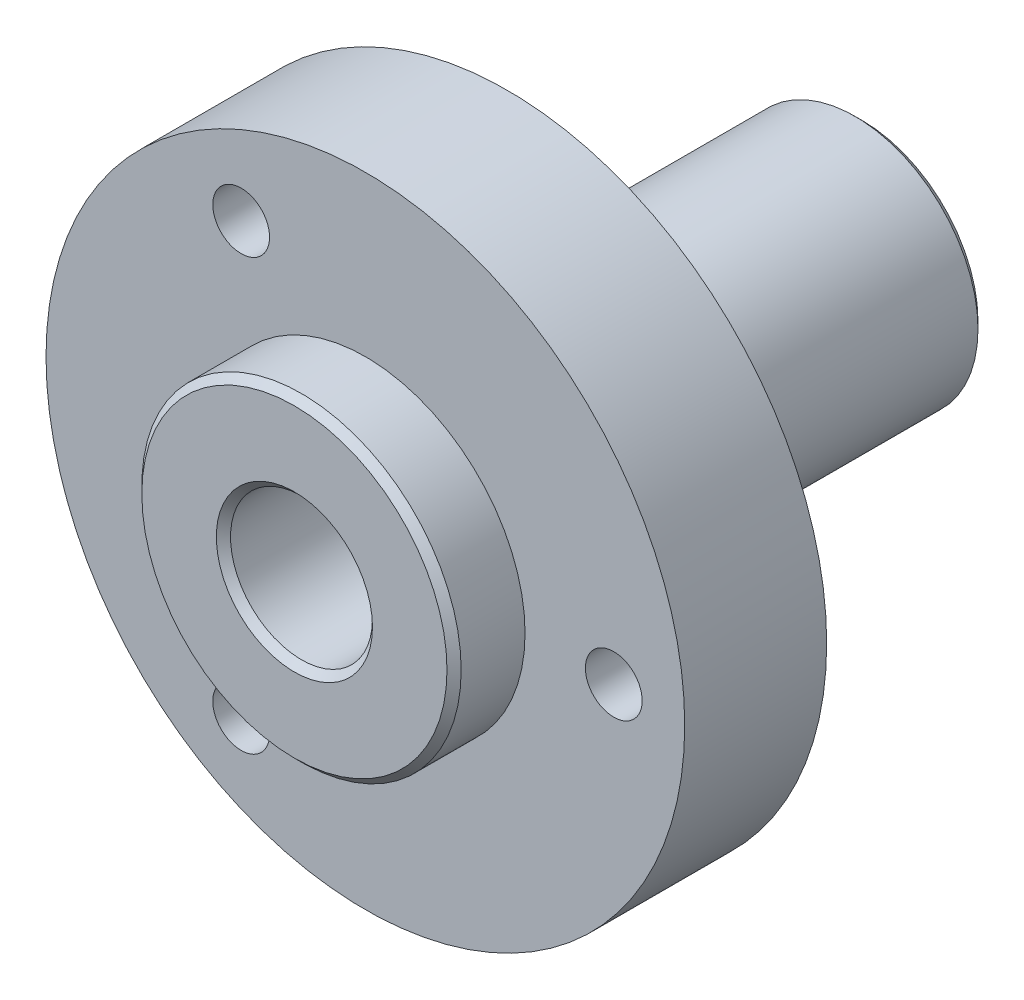
ISO-10303-21;
HEADER;
FILE_DESCRIPTION(('STEP AP214'),'2;1');
FILE_NAME('part.step','',(''),(''),'','','');
FILE_SCHEMA(('AUTOMOTIVE_DESIGN { 1 0 10303 214 1 1 1 1 }'));
ENDSEC;
DATA;
#1=APPLICATION_CONTEXT('core data for automotive mechanical design processes');
#2=APPLICATION_PROTOCOL_DEFINITION('international standard','automotive_design',2000,#1);
#3=PRODUCT_CONTEXT('',#1,'mechanical');
#4=PRODUCT('Part','Part','',(#3));
#5=PRODUCT_RELATED_PRODUCT_CATEGORY('part','',(#4));
#6=PRODUCT_DEFINITION_FORMATION('','',#4);
#7=PRODUCT_DEFINITION_CONTEXT('part definition',#1,'design');
#8=PRODUCT_DEFINITION('design','',#6,#7);
#9=PRODUCT_DEFINITION_SHAPE('','',#8);
#10=(LENGTH_UNIT() NAMED_UNIT(*) SI_UNIT(.MILLI.,.METRE.));
#11=(NAMED_UNIT(*) PLANE_ANGLE_UNIT() SI_UNIT($,.RADIAN.));
#12=(NAMED_UNIT(*) SI_UNIT($,.STERADIAN.) SOLID_ANGLE_UNIT());
#13=UNCERTAINTY_MEASURE_WITH_UNIT(LENGTH_MEASURE(1.E-05),#10,'distance_accuracy_value','');
#14=(GEOMETRIC_REPRESENTATION_CONTEXT(3) GLOBAL_UNCERTAINTY_ASSIGNED_CONTEXT((#13)) GLOBAL_UNIT_ASSIGNED_CONTEXT((#10,
#11,#12)) REPRESENTATION_CONTEXT('',''));
#15=CARTESIAN_POINT('',(0.,0.,0.));
#16=DIRECTION('',(0.,0.,1.));
#17=DIRECTION('',(1.,0.,0.));
#18=AXIS2_PLACEMENT_3D('',#15,#16,#17);
#19=CARTESIAN_POINT('',(0.,0.,-2.));
#20=DIRECTION('',(0.,0.,1.));
#21=DIRECTION('',(1.,0.,0.));
#22=AXIS2_PLACEMENT_3D('',#19,#20,#21);
#23=CYLINDRICAL_SURFACE('',#22,4.5);
#24=CARTESIAN_POINT('',(0.,0.,-0.199999999999994));
#25=DIRECTION('',(0.,0.,1.));
#26=DIRECTION('',(1.,0.,0.));
#27=AXIS2_PLACEMENT_3D('',#24,#25,#26);
#28=CIRCLE('',#27,4.5);
#29=CARTESIAN_POINT('',(4.5,0.,-0.199999999999994));
#30=VERTEX_POINT('',#29);
#31=EDGE_CURVE('E10',#30,#30,#28,.F.);
#32=ORIENTED_EDGE('',*,*,#31,.T.);
#33=EDGE_LOOP('',(#32));
#34=FACE_BOUND('',#33,.T.);
#35=CARTESIAN_POINT('',(0.,0.,-2.));
#36=DIRECTION('',(0.,0.,1.));
#37=DIRECTION('',(1.,0.,0.));
#38=AXIS2_PLACEMENT_3D('',#35,#36,#37);
#39=CIRCLE('',#38,4.5);
#40=CARTESIAN_POINT('',(4.5,0.,-2.));
#41=VERTEX_POINT('',#40);
#42=EDGE_CURVE('E77',#41,#41,#39,.T.);
#43=ORIENTED_EDGE('',*,*,#42,.T.);
#44=EDGE_LOOP('',(#43));
#45=FACE_BOUND('',#44,.T.);
#46=ADVANCED_FACE('F34',(#34,#45),#23,.T.);
#47=CARTESIAN_POINT('',(0.,0.,0.));
#48=DIRECTION('',(0.,0.,1.));
#49=DIRECTION('',(1.,0.,0.));
#50=AXIS2_PLACEMENT_3D('',#47,#48,#49);
#51=PLANE('',#50);
#52=CARTESIAN_POINT('',(0.,0.,0.));
#53=DIRECTION('',(0.,0.,1.));
#54=DIRECTION('',(1.,0.,0.));
#55=AXIS2_PLACEMENT_3D('',#52,#53,#54);
#56=CIRCLE('',#55,4.30000000000001);
#57=CARTESIAN_POINT('',(4.30000000000001,0.,0.));
#58=VERTEX_POINT('',#57);
#59=EDGE_CURVE('E41',#58,#58,#56,.T.);
#60=ORIENTED_EDGE('',*,*,#59,.T.);
#61=EDGE_LOOP('',(#60));
#62=FACE_BOUND('',#61,.T.);
#63=CARTESIAN_POINT('',(0.,0.,0.));
#64=DIRECTION('',(0.,0.,1.));
#65=DIRECTION('',(1.,0.,0.));
#66=AXIS2_PLACEMENT_3D('',#63,#64,#65);
#67=CIRCLE('',#66,2.2);
#68=CARTESIAN_POINT('',(2.2,0.,0.));
#69=VERTEX_POINT('',#68);
#70=EDGE_CURVE('E45',#69,#69,#67,.F.);
#71=ORIENTED_EDGE('',*,*,#70,.T.);
#72=EDGE_LOOP('',(#71));
#73=FACE_BOUND('',#72,.T.);
#74=ADVANCED_FACE('F115',(#62,#73),#51,.T.);
#75=CARTESIAN_POINT('',(0.,0.,-6.));
#76=DIRECTION('',(0.,0.,1.));
#77=DIRECTION('',(1.,0.,0.));
#78=AXIS2_PLACEMENT_3D('',#75,#76,#77);
#79=CYLINDRICAL_SURFACE('',#78,9.);
#80=CARTESIAN_POINT('',(0.,0.,-6.));
#81=DIRECTION('',(0.,0.,-1.));
#82=DIRECTION('',(-1.,0.,0.));
#83=AXIS2_PLACEMENT_3D('',#80,#81,#82);
#84=CIRCLE('',#83,9.);
#85=CARTESIAN_POINT('',(-9.,0.,-6.));
#86=VERTEX_POINT('',#85);
#87=EDGE_CURVE('E80',#86,#86,#84,.T.);
#88=ORIENTED_EDGE('',*,*,#87,.F.);
#89=EDGE_LOOP('',(#88));
#90=FACE_BOUND('',#89,.T.);
#91=CARTESIAN_POINT('',(0.,0.,-2.));
#92=DIRECTION('',(0.,0.,-1.));
#93=DIRECTION('',(-1.,0.,0.));
#94=AXIS2_PLACEMENT_3D('',#91,#92,#93);
#95=CIRCLE('',#94,9.);
#96=CARTESIAN_POINT('',(-9.,0.,-2.));
#97=VERTEX_POINT('',#96);
#98=EDGE_CURVE('E75',#97,#97,#95,.T.);
#99=ORIENTED_EDGE('',*,*,#98,.T.);
#100=EDGE_LOOP('',(#99));
#101=FACE_BOUND('',#100,.T.);
#102=ADVANCED_FACE('F113',(#90,#101),#79,.T.);
#103=CARTESIAN_POINT('',(0.,0.,-6.));
#104=DIRECTION('',(0.,0.,-1.));
#105=DIRECTION('',(-1.,0.,0.));
#106=AXIS2_PLACEMENT_3D('',#103,#104,#105);
#107=PLANE('',#106);
#108=CARTESIAN_POINT('',(-3.50000000000017,6.06217782649078,-6.));
#109=DIRECTION('',(0.,0.,-1.));
#110=DIRECTION('',(-1.,0.,0.));
#111=AXIS2_PLACEMENT_3D('',#108,#109,#110);
#112=CIRCLE('',#111,0.799999999999999);
#113=CARTESIAN_POINT('',(-4.30000000000017,6.06217782649078,-6.));
#114=VERTEX_POINT('',#113);
#115=EDGE_CURVE('E67',#114,#114,#112,.T.);
#116=ORIENTED_EDGE('',*,*,#115,.F.);
#117=EDGE_LOOP('',(#116));
#118=FACE_BOUND('',#117,.T.);
#119=CARTESIAN_POINT('',(-3.49999999999983,-6.06217782649136,-6.));
#120=DIRECTION('',(0.,0.,-1.));
#121=DIRECTION('',(-1.,0.,0.));
#122=AXIS2_PLACEMENT_3D('',#119,#120,#121);
#123=CIRCLE('',#122,0.799999999999999);
#124=CARTESIAN_POINT('',(-4.29999999999983,-6.06217782649136,-6.));
#125=VERTEX_POINT('',#124);
#126=EDGE_CURVE('E89',#125,#125,#123,.T.);
#127=ORIENTED_EDGE('',*,*,#126,.F.);
#128=EDGE_LOOP('',(#127));
#129=FACE_BOUND('',#128,.T.);
#130=CARTESIAN_POINT('',(7.,0.,-6.));
#131=DIRECTION('',(0.,0.,-1.));
#132=DIRECTION('',(-1.,0.,0.));
#133=AXIS2_PLACEMENT_3D('',#130,#131,#132);
#134=CIRCLE('',#133,0.799999999999999);
#135=CARTESIAN_POINT('',(6.2,0.,-6.));
#136=VERTEX_POINT('',#135);
#137=EDGE_CURVE('E72',#136,#136,#134,.T.);
#138=ORIENTED_EDGE('',*,*,#137,.F.);
#139=EDGE_LOOP('',(#138));
#140=FACE_BOUND('',#139,.T.);
#141=CARTESIAN_POINT('',(0.,0.,-6.));
#142=DIRECTION('',(0.,0.,-1.));
#143=DIRECTION('',(-1.,0.,0.));
#144=AXIS2_PLACEMENT_3D('',#141,#142,#143);
#145=CIRCLE('',#144,3.46378773558281);
#146=CARTESIAN_POINT('',(-3.46378773558281,0.,-6.));
#147=VERTEX_POINT('',#146);
#148=EDGE_CURVE('E66',#147,#147,#145,.T.);
#149=ORIENTED_EDGE('',*,*,#148,.F.);
#150=EDGE_LOOP('',(#149));
#151=FACE_BOUND('',#150,.T.);
#152=ORIENTED_EDGE('',*,*,#87,.T.);
#153=EDGE_LOOP('',(#152));
#154=FACE_BOUND('',#153,.T.);
#155=ADVANCED_FACE('F103',(#118,#129,#140,#151,#154),#107,.T.);
#156=CARTESIAN_POINT('',(0.,0.,-2.));
#157=DIRECTION('',(0.,0.,-1.));
#158=DIRECTION('',(-1.,0.,0.));
#159=AXIS2_PLACEMENT_3D('',#156,#157,#158);
#160=PLANE('',#159);
#161=CARTESIAN_POINT('',(-3.50000000000017,6.06217782649078,-2.));
#162=DIRECTION('',(0.,0.,1.));
#163=DIRECTION('',(1.,0.,0.));
#164=AXIS2_PLACEMENT_3D('',#161,#162,#163);
#165=CIRCLE('',#164,0.8);
#166=CARTESIAN_POINT('',(-2.70000000000017,6.06217782649078,-2.));
#167=VERTEX_POINT('',#166);
#168=EDGE_CURVE('E71',#167,#167,#165,.T.);
#169=ORIENTED_EDGE('',*,*,#168,.F.);
#170=EDGE_LOOP('',(#169));
#171=FACE_BOUND('',#170,.T.);
#172=CARTESIAN_POINT('',(-3.49999999999983,-6.06217782649136,-2.));
#173=DIRECTION('',(0.,0.,1.));
#174=DIRECTION('',(1.,0.,0.));
#175=AXIS2_PLACEMENT_3D('',#172,#173,#174);
#176=CIRCLE('',#175,0.8);
#177=CARTESIAN_POINT('',(-2.69999999999983,-6.06217782649136,-2.));
#178=VERTEX_POINT('',#177);
#179=EDGE_CURVE('E70',#178,#178,#176,.T.);
#180=ORIENTED_EDGE('',*,*,#179,.F.);
#181=EDGE_LOOP('',(#180));
#182=FACE_BOUND('',#181,.T.);
#183=CARTESIAN_POINT('',(7.,0.,-2.));
#184=DIRECTION('',(0.,0.,1.));
#185=DIRECTION('',(1.,0.,0.));
#186=AXIS2_PLACEMENT_3D('',#183,#184,#185);
#187=CIRCLE('',#186,0.8);
#188=CARTESIAN_POINT('',(7.8,0.,-2.));
#189=VERTEX_POINT('',#188);
#190=EDGE_CURVE('E76',#189,#189,#187,.T.);
#191=ORIENTED_EDGE('',*,*,#190,.F.);
#192=EDGE_LOOP('',(#191));
#193=FACE_BOUND('',#192,.T.);
#194=ORIENTED_EDGE('',*,*,#42,.F.);
#195=EDGE_LOOP('',(#194));
#196=FACE_BOUND('',#195,.T.);
#197=ORIENTED_EDGE('',*,*,#98,.F.);
#198=EDGE_LOOP('',(#197));
#199=FACE_BOUND('',#198,.T.);
#200=ADVANCED_FACE('F99',(#171,#182,#193,#196,#199),#160,.F.);
#201=CARTESIAN_POINT('',(0.,0.,-16.));
#202=DIRECTION('',(0.,0.,1.));
#203=DIRECTION('',(1.,0.,0.));
#204=AXIS2_PLACEMENT_3D('',#201,#202,#203);
#205=CYLINDRICAL_SURFACE('',#204,3.46378773558281);
#206=CARTESIAN_POINT('',(0.,0.,-15.8));
#207=DIRECTION('',(0.,0.,-1.));
#208=DIRECTION('',(-1.,0.,0.));
#209=AXIS2_PLACEMENT_3D('',#206,#207,#208);
#210=CIRCLE('',#209,3.46378773558281);
#211=CARTESIAN_POINT('',(-3.46378773558281,0.,-15.8));
#212=VERTEX_POINT('',#211);
#213=EDGE_CURVE('E57',#212,#212,#210,.F.);
#214=ORIENTED_EDGE('',*,*,#213,.T.);
#215=EDGE_LOOP('',(#214));
#216=FACE_BOUND('',#215,.T.);
#217=ORIENTED_EDGE('',*,*,#148,.T.);
#218=EDGE_LOOP('',(#217));
#219=FACE_BOUND('',#218,.T.);
#220=ADVANCED_FACE('F102',(#216,#219),#205,.T.);
#221=CARTESIAN_POINT('',(0.,0.,-16.));
#222=DIRECTION('',(0.,0.,-1.));
#223=DIRECTION('',(-1.,0.,0.));
#224=AXIS2_PLACEMENT_3D('',#221,#222,#223);
#225=PLANE('',#224);
#226=CARTESIAN_POINT('',(0.,0.,-16.));
#227=DIRECTION('',(0.,0.,-1.));
#228=DIRECTION('',(-1.,0.,0.));
#229=AXIS2_PLACEMENT_3D('',#226,#227,#228);
#230=CIRCLE('',#229,3.2637877355828);
#231=CARTESIAN_POINT('',(-3.2637877355828,0.,-16.));
#232=VERTEX_POINT('',#231);
#233=EDGE_CURVE('E60',#232,#232,#230,.T.);
#234=ORIENTED_EDGE('',*,*,#233,.T.);
#235=EDGE_LOOP('',(#234));
#236=FACE_BOUND('',#235,.T.);
#237=CARTESIAN_POINT('',(0.,0.,-16.));
#238=DIRECTION('',(0.,0.,-1.));
#239=DIRECTION('',(-1.,0.,0.));
#240=AXIS2_PLACEMENT_3D('',#237,#238,#239);
#241=CIRCLE('',#240,2.2);
#242=CARTESIAN_POINT('',(-2.2,0.,-16.));
#243=VERTEX_POINT('',#242);
#244=EDGE_CURVE('E63',#243,#243,#241,.F.);
#245=ORIENTED_EDGE('',*,*,#244,.T.);
#246=EDGE_LOOP('',(#245));
#247=FACE_BOUND('',#246,.T.);
#248=ADVANCED_FACE('F170',(#236,#247),#225,.T.);
#249=CARTESIAN_POINT('',(7.,0.,-2.));
#250=DIRECTION('',(0.,0.,1.));
#251=DIRECTION('',(1.,0.,0.));
#252=AXIS2_PLACEMENT_3D('',#249,#250,#251);
#253=CYLINDRICAL_SURFACE('',#252,0.799999999999999);
#254=ORIENTED_EDGE('',*,*,#137,.T.);
#255=EDGE_LOOP('',(#254));
#256=FACE_BOUND('',#255,.T.);
#257=ORIENTED_EDGE('',*,*,#190,.T.);
#258=EDGE_LOOP('',(#257));
#259=FACE_BOUND('',#258,.T.);
#260=ADVANCED_FACE('F166',(#256,#259),#253,.F.);
#261=CARTESIAN_POINT('',(-3.49999999999983,-6.06217782649136,-2.));
#262=DIRECTION('',(0.,0.,1.));
#263=DIRECTION('',(1.,0.,0.));
#264=AXIS2_PLACEMENT_3D('',#261,#262,#263);
#265=CYLINDRICAL_SURFACE('',#264,0.799999999999999);
#266=ORIENTED_EDGE('',*,*,#126,.T.);
#267=EDGE_LOOP('',(#266));
#268=FACE_BOUND('',#267,.T.);
#269=ORIENTED_EDGE('',*,*,#179,.T.);
#270=EDGE_LOOP('',(#269));
#271=FACE_BOUND('',#270,.T.);
#272=ADVANCED_FACE('F160',(#268,#271),#265,.F.);
#273=CARTESIAN_POINT('',(-3.50000000000017,6.06217782649078,-2.));
#274=DIRECTION('',(0.,0.,1.));
#275=DIRECTION('',(1.,0.,0.));
#276=AXIS2_PLACEMENT_3D('',#273,#274,#275);
#277=CYLINDRICAL_SURFACE('',#276,0.799999999999999);
#278=ORIENTED_EDGE('',*,*,#115,.T.);
#279=EDGE_LOOP('',(#278));
#280=FACE_BOUND('',#279,.T.);
#281=ORIENTED_EDGE('',*,*,#168,.T.);
#282=EDGE_LOOP('',(#281));
#283=FACE_BOUND('',#282,.T.);
#284=ADVANCED_FACE('F97',(#280,#283),#277,.F.);
#285=CARTESIAN_POINT('',(0.,0.,-16.));
#286=DIRECTION('',(0.,0.,1.));
#287=DIRECTION('',(1.,0.,0.));
#288=AXIS2_PLACEMENT_3D('',#285,#286,#287);
#289=CYLINDRICAL_SURFACE('',#288,2.);
#290=CARTESIAN_POINT('',(0.,0.,-15.8));
#291=DIRECTION('',(0.,0.,-1.));
#292=DIRECTION('',(-1.,0.,0.));
#293=AXIS2_PLACEMENT_3D('',#290,#291,#292);
#294=CIRCLE('',#293,2.);
#295=CARTESIAN_POINT('',(-2.,0.,-15.8));
#296=VERTEX_POINT('',#295);
#297=EDGE_CURVE('E49',#296,#296,#294,.T.);
#298=ORIENTED_EDGE('',*,*,#297,.T.);
#299=EDGE_LOOP('',(#298));
#300=FACE_BOUND('',#299,.T.);
#301=CARTESIAN_POINT('',(0.,0.,-0.199999999999999));
#302=DIRECTION('',(0.,0.,1.));
#303=DIRECTION('',(1.,0.,0.));
#304=AXIS2_PLACEMENT_3D('',#301,#302,#303);
#305=CIRCLE('',#304,2.);
#306=CARTESIAN_POINT('',(2.,0.,-0.199999999999999));
#307=VERTEX_POINT('',#306);
#308=EDGE_CURVE('E54',#307,#307,#305,.T.);
#309=ORIENTED_EDGE('',*,*,#308,.T.);
#310=EDGE_LOOP('',(#309));
#311=FACE_BOUND('',#310,.T.);
#312=ADVANCED_FACE('F136',(#300,#311),#289,.F.);
#313=CARTESIAN_POINT('',(0.,0.,-16.));
#314=DIRECTION('',(0.,0.,1.));
#315=DIRECTION('',(1.,0.,0.));
#316=AXIS2_PLACEMENT_3D('',#313,#314,#315);
#317=CONICAL_SURFACE('',#316,3.2637877355828,0.785398163397448);
#318=ORIENTED_EDGE('',*,*,#213,.F.);
#319=EDGE_LOOP('',(#318));
#320=FACE_BOUND('',#319,.T.);
#321=ORIENTED_EDGE('',*,*,#233,.F.);
#322=EDGE_LOOP('',(#321));
#323=FACE_BOUND('',#322,.T.);
#324=ADVANCED_FACE('F132',(#320,#323),#317,.T.);
#325=CARTESIAN_POINT('',(0.,0.,-16.));
#326=DIRECTION('',(0.,0.,-1.));
#327=DIRECTION('',(-1.,0.,0.));
#328=AXIS2_PLACEMENT_3D('',#325,#326,#327);
#329=CONICAL_SURFACE('',#328,2.2,0.785398163397453);
#330=ORIENTED_EDGE('',*,*,#297,.F.);
#331=EDGE_LOOP('',(#330));
#332=FACE_BOUND('',#331,.T.);
#333=ORIENTED_EDGE('',*,*,#244,.F.);
#334=EDGE_LOOP('',(#333));
#335=FACE_BOUND('',#334,.T.);
#336=ADVANCED_FACE('F135',(#332,#335),#329,.F.);
#337=CARTESIAN_POINT('',(0.,0.,0.));
#338=DIRECTION('',(0.,0.,-1.));
#339=DIRECTION('',(-1.,0.,0.));
#340=AXIS2_PLACEMENT_3D('',#337,#338,#339);
#341=CONICAL_SURFACE('',#340,4.30000000000001,0.78539816339744);
#342=ORIENTED_EDGE('',*,*,#31,.F.);
#343=EDGE_LOOP('',(#342));
#344=FACE_BOUND('',#343,.T.);
#345=ORIENTED_EDGE('',*,*,#59,.F.);
#346=EDGE_LOOP('',(#345));
#347=FACE_BOUND('',#346,.T.);
#348=ADVANCED_FACE('F139',(#344,#347),#341,.T.);
#349=CARTESIAN_POINT('',(0.,0.,-0.199999999999999));
#350=DIRECTION('',(0.,0.,1.));
#351=DIRECTION('',(1.,0.,0.));
#352=AXIS2_PLACEMENT_3D('',#349,#350,#351);
#353=CONICAL_SURFACE('',#352,2.,0.785398163397453);
#354=ORIENTED_EDGE('',*,*,#70,.F.);
#355=EDGE_LOOP('',(#354));
#356=FACE_BOUND('',#355,.T.);
#357=ORIENTED_EDGE('',*,*,#308,.F.);
#358=EDGE_LOOP('',(#357));
#359=FACE_BOUND('',#358,.T.);
#360=ADVANCED_FACE('F36',(#356,#359),#353,.F.);
#361=CLOSED_SHELL('',(#46,#74,#102,#155,#200,#220,#248,#260,#272,#284,#312,#324,#336,#348,#360));
#362=MANIFOLD_SOLID_BREP('B2',#361);
#363=ADVANCED_BREP_SHAPE_REPRESENTATION('',(#18,#362),#14);
#364=SHAPE_DEFINITION_REPRESENTATION(#9,#363);
ENDSEC;
END-ISO-10303-21;
